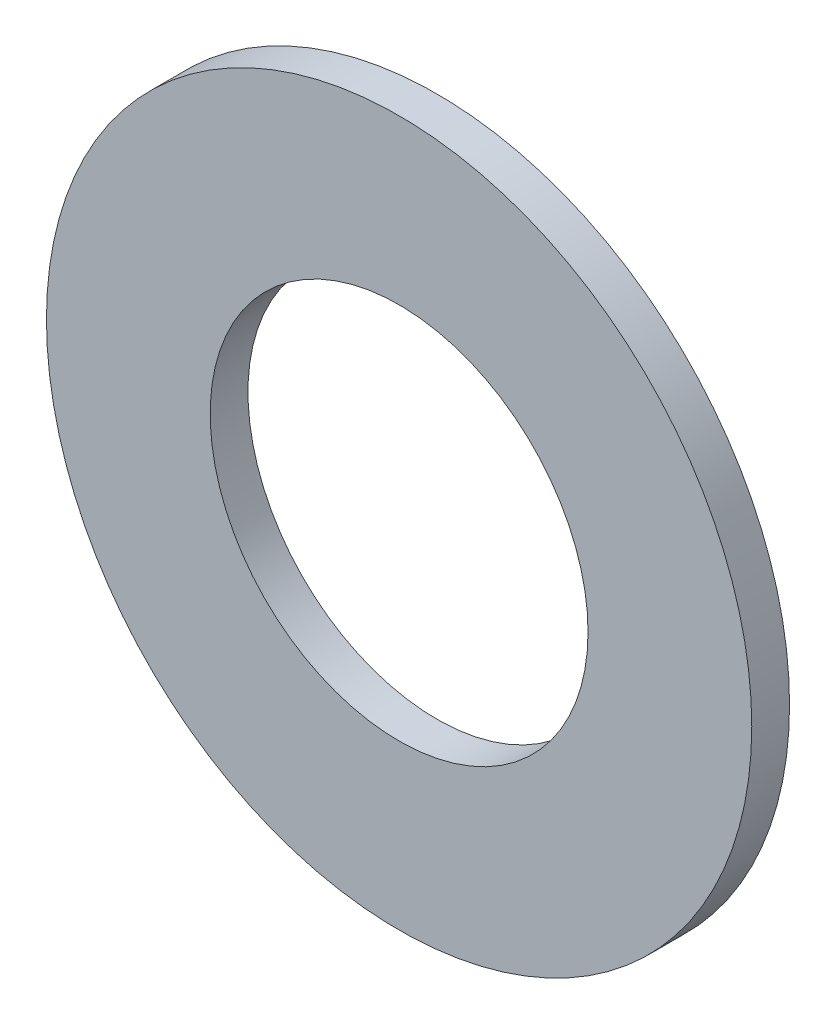
ISO-10303-21;
HEADER;
FILE_DESCRIPTION(('STEP AP214'),'2;1');
FILE_NAME('part.step','',(''),(''),'','','');
FILE_SCHEMA(('AUTOMOTIVE_DESIGN { 1 0 10303 214 1 1 1 1 }'));
ENDSEC;
DATA;
#1=APPLICATION_CONTEXT('core data for automotive mechanical design processes');
#2=APPLICATION_PROTOCOL_DEFINITION('international standard','automotive_design',2000,#1);
#3=PRODUCT_CONTEXT('',#1,'mechanical');
#4=PRODUCT('Part','Part','',(#3));
#5=PRODUCT_RELATED_PRODUCT_CATEGORY('part','',(#4));
#6=PRODUCT_DEFINITION_FORMATION('','',#4);
#7=PRODUCT_DEFINITION_CONTEXT('part definition',#1,'design');
#8=PRODUCT_DEFINITION('design','',#6,#7);
#9=PRODUCT_DEFINITION_SHAPE('','',#8);
#10=(LENGTH_UNIT() NAMED_UNIT(*) SI_UNIT(.MILLI.,.METRE.));
#11=(NAMED_UNIT(*) PLANE_ANGLE_UNIT() SI_UNIT($,.RADIAN.));
#12=(NAMED_UNIT(*) SI_UNIT($,.STERADIAN.) SOLID_ANGLE_UNIT());
#13=UNCERTAINTY_MEASURE_WITH_UNIT(LENGTH_MEASURE(1.E-05),#10,'distance_accuracy_value','');
#14=(GEOMETRIC_REPRESENTATION_CONTEXT(3) GLOBAL_UNCERTAINTY_ASSIGNED_CONTEXT((#13)) GLOBAL_UNIT_ASSIGNED_CONTEXT((#10,
#11,#12)) REPRESENTATION_CONTEXT('',''));
#15=CARTESIAN_POINT('',(0.,0.,0.));
#16=DIRECTION('',(0.,0.,1.));
#17=DIRECTION('',(1.,0.,0.));
#18=AXIS2_PLACEMENT_3D('',#15,#16,#17);
#19=CARTESIAN_POINT('',(0.,0.,1.5));
#20=DIRECTION('',(0.,0.,1.));
#21=DIRECTION('',(1.,0.,0.));
#22=AXIS2_PLACEMENT_3D('',#19,#20,#21);
#23=PLANE('',#22);
#24=CARTESIAN_POINT('',(0.,0.,1.5));
#25=DIRECTION('',(0.,0.,1.));
#26=DIRECTION('',(1.,0.,0.));
#27=AXIS2_PLACEMENT_3D('',#24,#25,#26);
#28=CIRCLE('',#27,14.);
#29=CARTESIAN_POINT('',(14.,0.,1.5));
#30=VERTEX_POINT('',#29);
#31=EDGE_CURVE('E10',#30,#30,#28,.T.);
#32=ORIENTED_EDGE('',*,*,#31,.T.);
#33=EDGE_LOOP('',(#32));
#34=FACE_BOUND('',#33,.T.);
#35=CARTESIAN_POINT('',(0.,0.,1.5));
#36=DIRECTION('',(0.,0.,1.));
#37=DIRECTION('',(1.,0.,0.));
#38=AXIS2_PLACEMENT_3D('',#35,#36,#37);
#39=CIRCLE('',#38,7.5);
#40=CARTESIAN_POINT('',(7.5,0.,1.5));
#41=VERTEX_POINT('',#40);
#42=EDGE_CURVE('E55',#41,#41,#39,.T.);
#43=ORIENTED_EDGE('',*,*,#42,.F.);
#44=EDGE_LOOP('',(#43));
#45=FACE_BOUND('',#44,.T.);
#46=ADVANCED_FACE('F41',(#34,#45),#23,.T.);
#47=CARTESIAN_POINT('',(0.,0.,0.));
#48=DIRECTION('',(0.,0.,1.));
#49=DIRECTION('',(1.,0.,0.));
#50=AXIS2_PLACEMENT_3D('',#47,#48,#49);
#51=PLANE('',#50);
#52=CARTESIAN_POINT('',(0.,0.,0.));
#53=DIRECTION('',(0.,0.,1.));
#54=DIRECTION('',(1.,0.,0.));
#55=AXIS2_PLACEMENT_3D('',#52,#53,#54);
#56=CIRCLE('',#55,14.);
#57=CARTESIAN_POINT('',(14.,0.,0.));
#58=VERTEX_POINT('',#57);
#59=EDGE_CURVE('E45',#58,#58,#56,.T.);
#60=ORIENTED_EDGE('',*,*,#59,.F.);
#61=EDGE_LOOP('',(#60));
#62=FACE_BOUND('',#61,.T.);
#63=CARTESIAN_POINT('',(0.,0.,0.));
#64=DIRECTION('',(0.,0.,1.));
#65=DIRECTION('',(1.,0.,0.));
#66=AXIS2_PLACEMENT_3D('',#63,#64,#65);
#67=CIRCLE('',#66,7.5);
#68=CARTESIAN_POINT('',(7.5,0.,0.));
#69=VERTEX_POINT('',#68);
#70=EDGE_CURVE('E57',#69,#69,#67,.T.);
#71=ORIENTED_EDGE('',*,*,#70,.T.);
#72=EDGE_LOOP('',(#71));
#73=FACE_BOUND('',#72,.T.);
#74=ADVANCED_FACE('F68',(#62,#73),#51,.F.);
#75=CARTESIAN_POINT('',(0.,0.,1.5));
#76=DIRECTION('',(0.,0.,-1.));
#77=DIRECTION('',(-1.,0.,0.));
#78=AXIS2_PLACEMENT_3D('',#75,#76,#77);
#79=CYLINDRICAL_SURFACE('',#78,14.);
#80=ORIENTED_EDGE('',*,*,#31,.F.);
#81=EDGE_LOOP('',(#80));
#82=FACE_BOUND('',#81,.T.);
#83=ORIENTED_EDGE('',*,*,#59,.T.);
#84=EDGE_LOOP('',(#83));
#85=FACE_BOUND('',#84,.T.);
#86=ADVANCED_FACE('F43',(#82,#85),#79,.T.);
#87=CARTESIAN_POINT('',(0.,0.,1.5));
#88=DIRECTION('',(0.,0.,-1.));
#89=DIRECTION('',(-1.,0.,0.));
#90=AXIS2_PLACEMENT_3D('',#87,#88,#89);
#91=CYLINDRICAL_SURFACE('',#90,7.5);
#92=ORIENTED_EDGE('',*,*,#42,.T.);
#93=EDGE_LOOP('',(#92));
#94=FACE_BOUND('',#93,.T.);
#95=ORIENTED_EDGE('',*,*,#70,.F.);
#96=EDGE_LOOP('',(#95));
#97=FACE_BOUND('',#96,.T.);
#98=ADVANCED_FACE('F64',(#94,#97),#91,.F.);
#99=CLOSED_SHELL('',(#46,#74,#86,#98));
#100=MANIFOLD_SOLID_BREP('B2',#99);
#101=ADVANCED_BREP_SHAPE_REPRESENTATION('',(#18,#100),#14);
#102=SHAPE_DEFINITION_REPRESENTATION(#9,#101);
ENDSEC;
END-ISO-10303-21;
